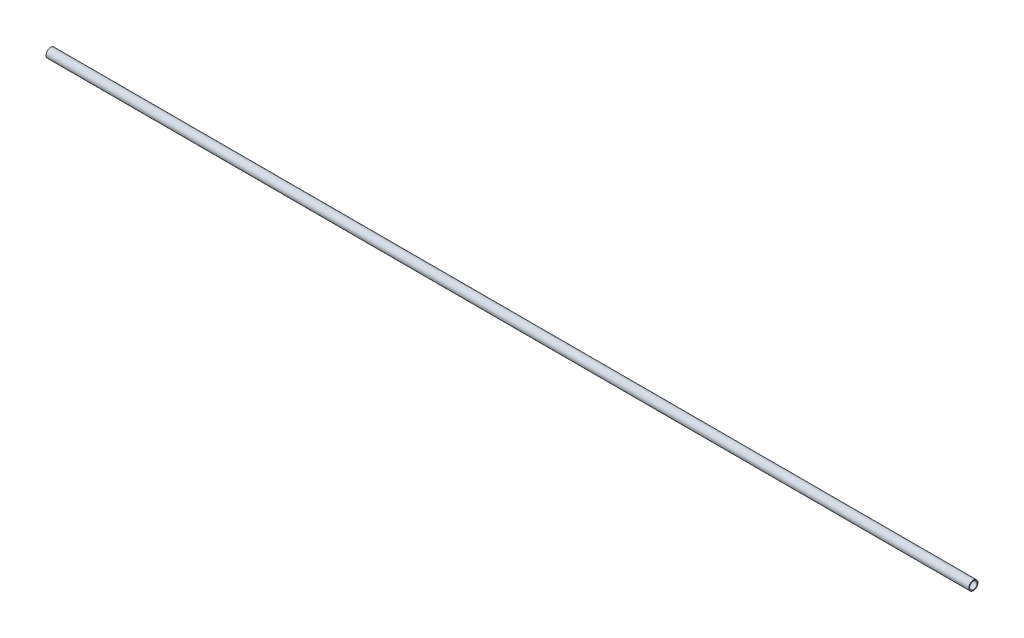
ISO-10303-21;
HEADER;
FILE_DESCRIPTION(('STEP AP214'),'2;1');
FILE_NAME('part.step','',(''),(''),'','','');
FILE_SCHEMA(('AUTOMOTIVE_DESIGN { 1 0 10303 214 1 1 1 1 }'));
ENDSEC;
DATA;
#1=APPLICATION_CONTEXT('core data for automotive mechanical design processes');
#2=APPLICATION_PROTOCOL_DEFINITION('international standard','automotive_design',2000,#1);
#3=PRODUCT_CONTEXT('',#1,'mechanical');
#4=PRODUCT('Part','Part','',(#3));
#5=PRODUCT_RELATED_PRODUCT_CATEGORY('part','',(#4));
#6=PRODUCT_DEFINITION_FORMATION('','',#4);
#7=PRODUCT_DEFINITION_CONTEXT('part definition',#1,'design');
#8=PRODUCT_DEFINITION('design','',#6,#7);
#9=PRODUCT_DEFINITION_SHAPE('','',#8);
#10=(LENGTH_UNIT() NAMED_UNIT(*) SI_UNIT(.MILLI.,.METRE.));
#11=(NAMED_UNIT(*) PLANE_ANGLE_UNIT() SI_UNIT($,.RADIAN.));
#12=(NAMED_UNIT(*) SI_UNIT($,.STERADIAN.) SOLID_ANGLE_UNIT());
#13=UNCERTAINTY_MEASURE_WITH_UNIT(LENGTH_MEASURE(1.E-05),#10,'distance_accuracy_value','');
#14=(GEOMETRIC_REPRESENTATION_CONTEXT(3) GLOBAL_UNCERTAINTY_ASSIGNED_CONTEXT((#13)) GLOBAL_UNIT_ASSIGNED_CONTEXT((#10,
#11,#12)) REPRESENTATION_CONTEXT('',''));
#15=CARTESIAN_POINT('',(0.,0.,0.));
#16=DIRECTION('',(0.,0.,1.));
#17=DIRECTION('',(1.,0.,0.));
#18=AXIS2_PLACEMENT_3D('',#15,#16,#17);
#19=CARTESIAN_POINT('',(0.,0.,0.));
#20=DIRECTION('',(1.,0.,0.));
#21=DIRECTION('',(0.,0.,-1.));
#22=AXIS2_PLACEMENT_3D('',#19,#20,#21);
#23=CYLINDRICAL_SURFACE('',#22,20.4);
#24=CARTESIAN_POINT('',(0.,0.,0.));
#25=DIRECTION('',(1.,0.,0.));
#26=DIRECTION('',(0.,0.,-1.));
#27=AXIS2_PLACEMENT_3D('',#24,#25,#26);
#28=CIRCLE('',#27,20.4);
#29=CARTESIAN_POINT('',(0.,0.,-20.4));
#30=VERTEX_POINT('',#29);
#31=EDGE_CURVE('E16',#30,#30,#28,.T.);
#32=ORIENTED_EDGE('',*,*,#31,.F.);
#33=EDGE_LOOP('',(#32));
#34=FACE_BOUND('',#33,.T.);
#35=CARTESIAN_POINT('',(5000.,0.,0.));
#36=DIRECTION('',(1.,0.,0.));
#37=DIRECTION('',(0.,0.,-1.));
#38=AXIS2_PLACEMENT_3D('',#35,#36,#37);
#39=CIRCLE('',#38,20.4);
#40=CARTESIAN_POINT('',(5000.,0.,-20.4));
#41=VERTEX_POINT('',#40);
#42=EDGE_CURVE('E25',#41,#41,#39,.F.);
#43=ORIENTED_EDGE('',*,*,#42,.F.);
#44=EDGE_LOOP('',(#43));
#45=FACE_BOUND('',#44,.T.);
#46=ADVANCED_FACE('F13',(#34,#45),#23,.F.);
#47=CARTESIAN_POINT('',(0.,-25.3000021083535,-25.));
#48=DIRECTION('',(-1.,0.,0.));
#49=DIRECTION('',(0.,0.,1.));
#50=AXIS2_PLACEMENT_3D('',#47,#48,#49);
#51=PLANE('',#50);
#52=ORIENTED_EDGE('',*,*,#31,.T.);
#53=EDGE_LOOP('',(#52));
#54=FACE_BOUND('',#53,.T.);
#55=CARTESIAN_POINT('',(0.,0.,0.));
#56=DIRECTION('',(1.,0.,0.));
#57=DIRECTION('',(0.,0.,-1.));
#58=AXIS2_PLACEMENT_3D('',#55,#56,#57);
#59=CIRCLE('',#58,25.);
#60=CARTESIAN_POINT('',(0.,0.,-25.));
#61=VERTEX_POINT('',#60);
#62=EDGE_CURVE('E20',#61,#61,#59,.T.);
#63=ORIENTED_EDGE('',*,*,#62,.F.);
#64=EDGE_LOOP('',(#63));
#65=FACE_BOUND('',#64,.T.);
#66=ADVANCED_FACE('F33',(#54,#65),#51,.T.);
#67=CARTESIAN_POINT('',(5000.,-25.3000021083535,25.));
#68=DIRECTION('',(1.,0.,0.));
#69=DIRECTION('',(0.,0.,-1.));
#70=AXIS2_PLACEMENT_3D('',#67,#68,#69);
#71=PLANE('',#70);
#72=ORIENTED_EDGE('',*,*,#42,.T.);
#73=EDGE_LOOP('',(#72));
#74=FACE_BOUND('',#73,.T.);
#75=CARTESIAN_POINT('',(5000.,0.,0.));
#76=DIRECTION('',(1.,0.,0.));
#77=DIRECTION('',(0.,0.,-1.));
#78=AXIS2_PLACEMENT_3D('',#75,#76,#77);
#79=CIRCLE('',#78,25.);
#80=CARTESIAN_POINT('',(5000.,0.,-25.));
#81=VERTEX_POINT('',#80);
#82=EDGE_CURVE('E8',#81,#81,#79,.F.);
#83=ORIENTED_EDGE('',*,*,#82,.F.);
#84=EDGE_LOOP('',(#83));
#85=FACE_BOUND('',#84,.T.);
#86=ADVANCED_FACE('F42',(#74,#85),#71,.T.);
#87=CARTESIAN_POINT('',(5000.,0.,0.));
#88=DIRECTION('',(1.,0.,0.));
#89=DIRECTION('',(0.,0.,-1.));
#90=AXIS2_PLACEMENT_3D('',#87,#88,#89);
#91=CYLINDRICAL_SURFACE('',#90,25.);
#92=ORIENTED_EDGE('',*,*,#62,.T.);
#93=EDGE_LOOP('',(#92));
#94=FACE_BOUND('',#93,.T.);
#95=ORIENTED_EDGE('',*,*,#82,.T.);
#96=EDGE_LOOP('',(#95));
#97=FACE_BOUND('',#96,.T.);
#98=ADVANCED_FACE('F43',(#94,#97),#91,.T.);
#99=CLOSED_SHELL('',(#46,#66,#86,#98));
#100=MANIFOLD_SOLID_BREP('B1',#99);
#101=ADVANCED_BREP_SHAPE_REPRESENTATION('',(#18,#100),#14);
#102=SHAPE_DEFINITION_REPRESENTATION(#9,#101);
ENDSEC;
END-ISO-10303-21;
